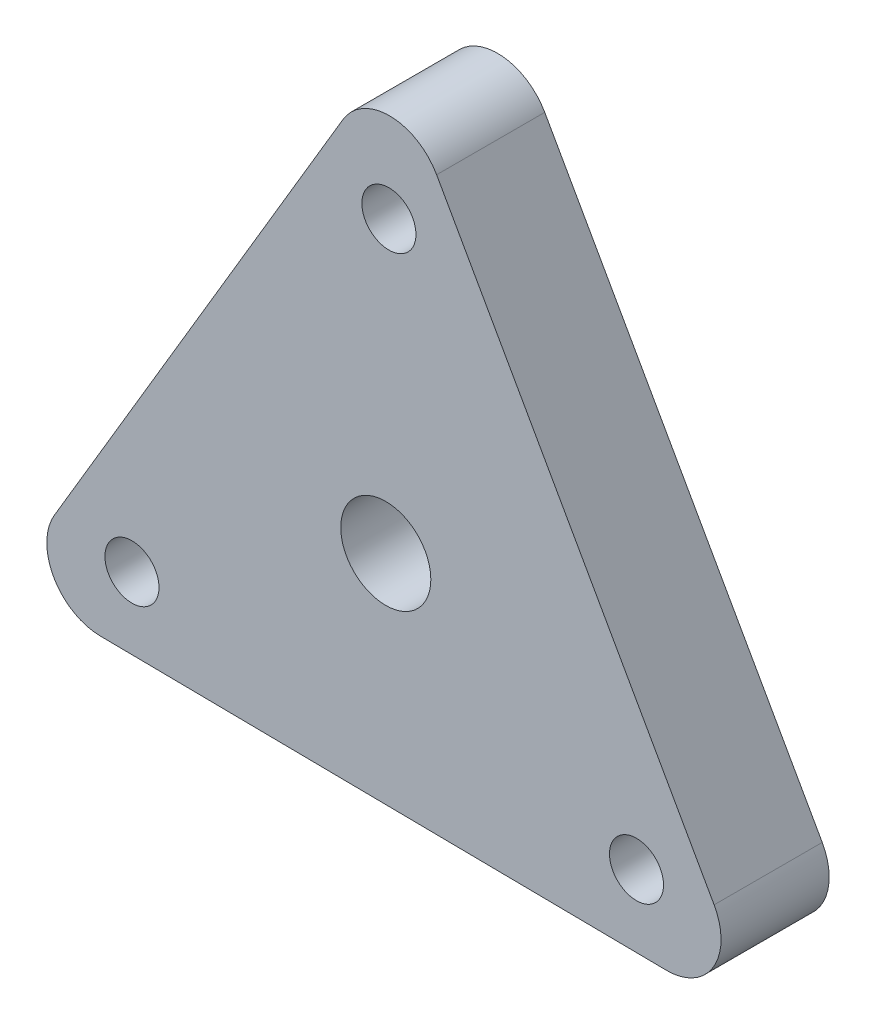
ISO-10303-21;
HEADER;
FILE_DESCRIPTION(('STEP AP214'),'2;1');
FILE_NAME('part.step','',(''),(''),'','','');
FILE_SCHEMA(('AUTOMOTIVE_DESIGN { 1 0 10303 214 1 1 1 1 }'));
ENDSEC;
DATA;
#1=APPLICATION_CONTEXT('core data for automotive mechanical design processes');
#2=APPLICATION_PROTOCOL_DEFINITION('international standard','automotive_design',2000,#1);
#3=PRODUCT_CONTEXT('',#1,'mechanical');
#4=PRODUCT('Part','Part','',(#3));
#5=PRODUCT_RELATED_PRODUCT_CATEGORY('part','',(#4));
#6=PRODUCT_DEFINITION_FORMATION('','',#4);
#7=PRODUCT_DEFINITION_CONTEXT('part definition',#1,'design');
#8=PRODUCT_DEFINITION('design','',#6,#7);
#9=PRODUCT_DEFINITION_SHAPE('','',#8);
#10=(LENGTH_UNIT() NAMED_UNIT(*) SI_UNIT(.MILLI.,.METRE.));
#11=(NAMED_UNIT(*) PLANE_ANGLE_UNIT() SI_UNIT($,.RADIAN.));
#12=(NAMED_UNIT(*) SI_UNIT($,.STERADIAN.) SOLID_ANGLE_UNIT());
#13=UNCERTAINTY_MEASURE_WITH_UNIT(LENGTH_MEASURE(1.E-05),#10,'distance_accuracy_value','');
#14=(GEOMETRIC_REPRESENTATION_CONTEXT(3) GLOBAL_UNCERTAINTY_ASSIGNED_CONTEXT((#13)) GLOBAL_UNIT_ASSIGNED_CONTEXT((#10,
#11,#12)) REPRESENTATION_CONTEXT('',''));
#15=CARTESIAN_POINT('',(0.,0.,0.));
#16=DIRECTION('',(0.,0.,1.));
#17=DIRECTION('',(1.,0.,0.));
#18=AXIS2_PLACEMENT_3D('',#15,#16,#17);
#19=CARTESIAN_POINT('',(-10.383384833885,6.1535165247396,6.));
#20=DIRECTION('',(0.860277013596666,-0.509826892069456,0.));
#21=DIRECTION('',(0.509826892069456,0.860277013596667,0.));
#22=AXIS2_PLACEMENT_3D('',#19,#20,#21);
#23=PLANE('',#22);
#24=DIRECTION('',(-0.509826892069456,-0.860277013596667,0.));
#25=VECTOR('',#24,1.);
#26=CARTESIAN_POINT('',(-10.383384833885,6.1535165247396,0.));
#27=LINE('',#26,#25);
#28=CARTESIAN_POINT('',(-2.37431980820905,19.6679361231694,0.));
#29=VERTEX_POINT('',#28);
#30=CARTESIAN_POINT('',(-18.392449859561,-7.36090307369022,0.));
#31=VERTEX_POINT('',#30);
#32=EDGE_CURVE('E116',#29,#31,#27,.T.);
#33=ORIENTED_EDGE('',*,*,#32,.T.);
#34=DIRECTION('',(0.,0.,-1.));
#35=VECTOR('',#34,1.);
#36=CARTESIAN_POINT('',(-18.392449859561,-7.36090307369022,6.));
#37=LINE('',#36,#35);
#38=CARTESIAN_POINT('',(-18.392449859561,-7.36090307369022,6.));
#39=VERTEX_POINT('',#38);
#40=EDGE_CURVE('E94',#31,#39,#37,.F.);
#41=ORIENTED_EDGE('',*,*,#40,.T.);
#42=DIRECTION('',(-0.509826892069456,-0.860277013596667,0.));
#43=VECTOR('',#42,1.);
#44=CARTESIAN_POINT('',(-10.383384833885,6.1535165247396,6.));
#45=LINE('',#44,#43);
#46=CARTESIAN_POINT('',(-2.37431980820905,19.6679361231694,6.));
#47=VERTEX_POINT('',#46);
#48=EDGE_CURVE('E142',#47,#39,#45,.T.);
#49=ORIENTED_EDGE('',*,*,#48,.F.);
#50=DIRECTION('',(0.,0.,-1.));
#51=VECTOR('',#50,1.);
#52=CARTESIAN_POINT('',(-2.37431980820905,19.6679361231694,6.));
#53=LINE('',#52,#51);
#54=EDGE_CURVE('E99',#47,#29,#53,.T.);
#55=ORIENTED_EDGE('',*,*,#54,.T.);
#56=EDGE_LOOP('',(#33,#41,#49,#55));
#57=FACE_BOUND('',#56,.T.);
#58=ADVANCED_FACE('F35',(#57),#23,.F.);
#59=CARTESIAN_POINT('',(-0.137409216089318,-12.0690333057843,6.));
#60=DIRECTION('',(0.0113845332662825,0.999935194101252,0.));
#61=DIRECTION('',(-0.999935194101252,0.0113845332662825,0.));
#62=AXIS2_PLACEMENT_3D('',#59,#60,#61);
#63=PLANE('',#62);
#64=DIRECTION('',(0.999935194101252,-0.0113845332662825,0.));
#65=VECTOR('',#64,1.);
#66=CARTESIAN_POINT('',(-0.137409216089318,-12.0690333057843,6.));
#67=LINE('',#66,#65);
#68=CARTESIAN_POINT('',(-15.8457724185698,-11.8901893322023,6.));
#69=VERTEX_POINT('',#68);
#70=CARTESIAN_POINT('',(15.5709539863912,-12.2478772793662,6.));
#71=VERTEX_POINT('',#70);
#72=EDGE_CURVE('E108',#69,#71,#67,.T.);
#73=ORIENTED_EDGE('',*,*,#72,.F.);
#74=DIRECTION('',(0.,0.,-1.));
#75=VECTOR('',#74,1.);
#76=CARTESIAN_POINT('',(-15.8457724185698,-11.8901893322023,6.));
#77=LINE('',#76,#75);
#78=CARTESIAN_POINT('',(-15.8457724185698,-11.8901893322023,0.));
#79=VERTEX_POINT('',#78);
#80=EDGE_CURVE('E93',#69,#79,#77,.T.);
#81=ORIENTED_EDGE('',*,*,#80,.T.);
#82=DIRECTION('',(0.999935194101252,-0.0113845332662825,0.));
#83=VECTOR('',#82,1.);
#84=CARTESIAN_POINT('',(-0.137409216089318,-12.0690333057843,0.));
#85=LINE('',#84,#83);
#86=CARTESIAN_POINT('',(15.5709539863912,-12.2478772793662,0.));
#87=VERTEX_POINT('',#86);
#88=EDGE_CURVE('E106',#79,#87,#85,.T.);
#89=ORIENTED_EDGE('',*,*,#88,.T.);
#90=DIRECTION('',(0.,0.,-1.));
#91=VECTOR('',#90,1.);
#92=CARTESIAN_POINT('',(15.5709539863912,-12.2478772793662,6.));
#93=LINE('',#92,#91);
#94=EDGE_CURVE('E110',#87,#71,#93,.F.);
#95=ORIENTED_EDGE('',*,*,#94,.T.);
#96=EDGE_LOOP('',(#73,#81,#89,#95));
#97=FACE_BOUND('',#96,.T.);
#98=ADVANCED_FACE('F105',(#97),#63,.F.);
#99=CARTESIAN_POINT('',(10.5207940499743,5.91551678104468,6.));
#100=DIRECTION('',(-0.871661546862949,-0.490108302031796,0.));
#101=DIRECTION('',(0.490108302031796,-0.871661546862949,0.));
#102=AXIS2_PLACEMENT_3D('',#99,#100,#101);
#103=PLANE('',#102);
#104=DIRECTION('',(-0.490108302031796,0.871661546862949,0.));
#105=VECTOR('',#104,1.);
#106=CARTESIAN_POINT('',(10.5207940499743,5.91551678104468,6.));
#107=LINE('',#106,#105);
#108=CARTESIAN_POINT('',(18.2200922267788,-7.77774679096706,6.));
#109=VERTEX_POINT('',#108);
#110=CARTESIAN_POINT('',(2.82149587316979,19.6087803530564,6.));
#111=VERTEX_POINT('',#110);
#112=EDGE_CURVE('E148',#109,#111,#107,.T.);
#113=ORIENTED_EDGE('',*,*,#112,.F.);
#114=DIRECTION('',(0.,0.,-1.));
#115=VECTOR('',#114,1.);
#116=CARTESIAN_POINT('',(18.2200922267788,-7.77774679096706,6.));
#117=LINE('',#116,#115);
#118=CARTESIAN_POINT('',(18.2200922267788,-7.77774679096706,0.));
#119=VERTEX_POINT('',#118);
#120=EDGE_CURVE('E11',#109,#119,#117,.T.);
#121=ORIENTED_EDGE('',*,*,#120,.T.);
#122=DIRECTION('',(-0.490108302031796,0.871661546862949,0.));
#123=VECTOR('',#122,1.);
#124=CARTESIAN_POINT('',(10.5207940499743,5.91551678104468,0.));
#125=LINE('',#124,#123);
#126=CARTESIAN_POINT('',(2.82149587316979,19.6087803530564,0.));
#127=VERTEX_POINT('',#126);
#128=EDGE_CURVE('E115',#119,#127,#125,.T.);
#129=ORIENTED_EDGE('',*,*,#128,.T.);
#130=DIRECTION('',(0.,0.,-1.));
#131=VECTOR('',#130,1.);
#132=CARTESIAN_POINT('',(2.82149587316979,19.6087803530564,6.));
#133=LINE('',#132,#131);
#134=EDGE_CURVE('E43',#127,#111,#133,.F.);
#135=ORIENTED_EDGE('',*,*,#134,.T.);
#136=EDGE_LOOP('',(#113,#121,#129,#135));
#137=FACE_BOUND('',#136,.T.);
#138=ADVANCED_FACE('F170',(#137),#103,.F.);
#139=CARTESIAN_POINT('',(13.9124878570264,-8.23261896126785,6.));
#140=DIRECTION('',(0.,0.,-1.));
#141=DIRECTION('',(-1.,0.,0.));
#142=AXIS2_PLACEMENT_3D('',#139,#140,#141);
#143=CYLINDRICAL_SURFACE('',#142,1.5);
#144=CARTESIAN_POINT('',(13.9124878570264,-8.23261896126785,6.));
#145=DIRECTION('',(0.,0.,1.));
#146=DIRECTION('',(1.,0.,0.));
#147=AXIS2_PLACEMENT_3D('',#144,#145,#146);
#148=CIRCLE('',#147,1.5);
#149=CARTESIAN_POINT('',(15.4124878570264,-8.23261896126785,6.));
#150=VERTEX_POINT('',#149);
#151=EDGE_CURVE('E146',#150,#150,#148,.T.);
#152=ORIENTED_EDGE('',*,*,#151,.T.);
#153=EDGE_LOOP('',(#152));
#154=FACE_BOUND('',#153,.T.);
#155=CARTESIAN_POINT('',(13.9124878570264,-8.23261896126785,0.));
#156=DIRECTION('',(0.,0.,1.));
#157=DIRECTION('',(1.,0.,0.));
#158=AXIS2_PLACEMENT_3D('',#155,#156,#157);
#159=CIRCLE('',#158,1.5);
#160=CARTESIAN_POINT('',(15.4124878570264,-8.23261896126785,0.));
#161=VERTEX_POINT('',#160);
#162=EDGE_CURVE('E120',#161,#161,#159,.T.);
#163=ORIENTED_EDGE('',*,*,#162,.F.);
#164=EDGE_LOOP('',(#163));
#165=FACE_BOUND('',#164,.T.);
#166=ADVANCED_FACE('F167',(#154,#165),#143,.F.);
#167=CARTESIAN_POINT('',(0.173413231622232,16.1648773946613,6.));
#168=DIRECTION('',(0.,0.,-1.));
#169=DIRECTION('',(-1.,0.,0.));
#170=AXIS2_PLACEMENT_3D('',#167,#168,#169);
#171=CYLINDRICAL_SURFACE('',#170,1.5);
#172=CARTESIAN_POINT('',(0.173413231622232,16.1648773946613,6.));
#173=DIRECTION('',(0.,0.,1.));
#174=DIRECTION('',(1.,0.,0.));
#175=AXIS2_PLACEMENT_3D('',#172,#173,#174);
#176=CIRCLE('',#175,1.5);
#177=CARTESIAN_POINT('',(1.67341323162223,16.1648773946613,6.));
#178=VERTEX_POINT('',#177);
#179=EDGE_CURVE('E151',#178,#178,#176,.T.);
#180=ORIENTED_EDGE('',*,*,#179,.T.);
#181=EDGE_LOOP('',(#180));
#182=FACE_BOUND('',#181,.T.);
#183=CARTESIAN_POINT('',(0.173413231622232,16.1648773946613,0.));
#184=DIRECTION('',(0.,0.,1.));
#185=DIRECTION('',(1.,0.,0.));
#186=AXIS2_PLACEMENT_3D('',#183,#184,#185);
#187=CIRCLE('',#186,1.5);
#188=CARTESIAN_POINT('',(1.67341323162223,16.1648773946613,0.));
#189=VERTEX_POINT('',#188);
#190=EDGE_CURVE('E161',#189,#189,#187,.T.);
#191=ORIENTED_EDGE('',*,*,#190,.F.);
#192=EDGE_LOOP('',(#191));
#193=FACE_BOUND('',#192,.T.);
#194=ADVANCED_FACE('F169',(#182,#193),#171,.F.);
#195=CARTESIAN_POINT('',(-14.0859010886486,-7.93225843339344,6.));
#196=DIRECTION('',(0.,0.,-1.));
#197=DIRECTION('',(-1.,0.,0.));
#198=AXIS2_PLACEMENT_3D('',#195,#196,#197);
#199=CYLINDRICAL_SURFACE('',#198,1.5);
#200=CARTESIAN_POINT('',(-14.0859010886486,-7.93225843339344,6.));
#201=DIRECTION('',(0.,0.,1.));
#202=DIRECTION('',(1.,0.,0.));
#203=AXIS2_PLACEMENT_3D('',#200,#201,#202);
#204=CIRCLE('',#203,1.5);
#205=CARTESIAN_POINT('',(-12.5859010886486,-7.93225843339344,6.));
#206=VERTEX_POINT('',#205);
#207=EDGE_CURVE('E126',#206,#206,#204,.T.);
#208=ORIENTED_EDGE('',*,*,#207,.T.);
#209=EDGE_LOOP('',(#208));
#210=FACE_BOUND('',#209,.T.);
#211=CARTESIAN_POINT('',(-14.0859010886486,-7.93225843339344,0.));
#212=DIRECTION('',(0.,0.,1.));
#213=DIRECTION('',(1.,0.,0.));
#214=AXIS2_PLACEMENT_3D('',#211,#212,#213);
#215=CIRCLE('',#214,1.5);
#216=CARTESIAN_POINT('',(-12.5859010886486,-7.93225843339344,0.));
#217=VERTEX_POINT('',#216);
#218=EDGE_CURVE('E158',#217,#217,#215,.T.);
#219=ORIENTED_EDGE('',*,*,#218,.F.);
#220=EDGE_LOOP('',(#219));
#221=FACE_BOUND('',#220,.T.);
#222=ADVANCED_FACE('F177',(#210,#221),#199,.F.);
#223=CARTESIAN_POINT('',(0.,0.,6.));
#224=DIRECTION('',(0.,0.,-1.));
#225=DIRECTION('',(-1.,0.,0.));
#226=AXIS2_PLACEMENT_3D('',#223,#224,#225);
#227=CYLINDRICAL_SURFACE('',#226,2.5);
#228=CARTESIAN_POINT('',(0.,0.,6.));
#229=DIRECTION('',(0.,0.,1.));
#230=DIRECTION('',(1.,0.,0.));
#231=AXIS2_PLACEMENT_3D('',#228,#229,#230);
#232=CIRCLE('',#231,2.5);
#233=CARTESIAN_POINT('',(2.5,0.,6.));
#234=VERTEX_POINT('',#233);
#235=EDGE_CURVE('E127',#234,#234,#232,.T.);
#236=ORIENTED_EDGE('',*,*,#235,.T.);
#237=EDGE_LOOP('',(#236));
#238=FACE_BOUND('',#237,.T.);
#239=CARTESIAN_POINT('',(0.,0.,0.));
#240=DIRECTION('',(0.,0.,1.));
#241=DIRECTION('',(1.,0.,0.));
#242=AXIS2_PLACEMENT_3D('',#239,#240,#241);
#243=CIRCLE('',#242,2.5);
#244=CARTESIAN_POINT('',(2.5,0.,0.));
#245=VERTEX_POINT('',#244);
#246=EDGE_CURVE('E118',#245,#245,#243,.T.);
#247=ORIENTED_EDGE('',*,*,#246,.F.);
#248=EDGE_LOOP('',(#247));
#249=FACE_BOUND('',#248,.T.);
#250=ADVANCED_FACE('F188',(#238,#249),#227,.F.);
#251=CARTESIAN_POINT('',(0.,0.,6.));
#252=DIRECTION('',(0.,0.,1.));
#253=DIRECTION('',(1.,0.,0.));
#254=AXIS2_PLACEMENT_3D('',#251,#252,#253);
#255=PLANE('',#254);
#256=ORIENTED_EDGE('',*,*,#207,.F.);
#257=EDGE_LOOP('',(#256));
#258=FACE_BOUND('',#257,.T.);
#259=ORIENTED_EDGE('',*,*,#179,.F.);
#260=EDGE_LOOP('',(#259));
#261=FACE_BOUND('',#260,.T.);
#262=ORIENTED_EDGE('',*,*,#151,.F.);
#263=EDGE_LOOP('',(#262));
#264=FACE_BOUND('',#263,.T.);
#265=ORIENTED_EDGE('',*,*,#48,.T.);
#266=CARTESIAN_POINT('',(-15.811618818771,-8.89038374989858,6.));
#267=DIRECTION('',(0.,0.,1.));
#268=DIRECTION('',(1.,0.,0.));
#269=AXIS2_PLACEMENT_3D('',#266,#267,#268);
#270=CIRCLE('',#269,3.);
#271=EDGE_CURVE('E137',#39,#69,#270,.T.);
#272=ORIENTED_EDGE('',*,*,#271,.T.);
#273=ORIENTED_EDGE('',*,*,#72,.T.);
#274=CARTESIAN_POINT('',(15.60510758619,-9.24807169706245,6.));
#275=DIRECTION('',(0.,0.,1.));
#276=DIRECTION('',(1.,0.,0.));
#277=AXIS2_PLACEMENT_3D('',#274,#275,#276);
#278=CIRCLE('',#277,3.);
#279=EDGE_CURVE('E56',#71,#109,#278,.T.);
#280=ORIENTED_EDGE('',*,*,#279,.T.);
#281=ORIENTED_EDGE('',*,*,#112,.T.);
#282=CARTESIAN_POINT('',(0.206511232580945,18.138455446961,6.));
#283=DIRECTION('',(0.,0.,1.));
#284=DIRECTION('',(1.,0.,0.));
#285=AXIS2_PLACEMENT_3D('',#282,#283,#284);
#286=CIRCLE('',#285,3.);
#287=EDGE_CURVE('E134',#111,#47,#286,.T.);
#288=ORIENTED_EDGE('',*,*,#287,.T.);
#289=EDGE_LOOP('',(#265,#272,#273,#280,#281,#288));
#290=FACE_BOUND('',#289,.T.);
#291=ORIENTED_EDGE('',*,*,#235,.F.);
#292=EDGE_LOOP('',(#291));
#293=FACE_BOUND('',#292,.T.);
#294=ADVANCED_FACE('F139',(#258,#261,#264,#290,#293),#255,.T.);
#295=CARTESIAN_POINT('',(0.,0.,0.));
#296=DIRECTION('',(0.,0.,1.));
#297=DIRECTION('',(1.,0.,0.));
#298=AXIS2_PLACEMENT_3D('',#295,#296,#297);
#299=PLANE('',#298);
#300=ORIENTED_EDGE('',*,*,#218,.T.);
#301=EDGE_LOOP('',(#300));
#302=FACE_BOUND('',#301,.T.);
#303=ORIENTED_EDGE('',*,*,#190,.T.);
#304=EDGE_LOOP('',(#303));
#305=FACE_BOUND('',#304,.T.);
#306=ORIENTED_EDGE('',*,*,#162,.T.);
#307=EDGE_LOOP('',(#306));
#308=FACE_BOUND('',#307,.T.);
#309=ORIENTED_EDGE('',*,*,#88,.F.);
#310=CARTESIAN_POINT('',(-15.811618818771,-8.89038374989858,0.));
#311=DIRECTION('',(0.,0.,1.));
#312=DIRECTION('',(1.,0.,0.));
#313=AXIS2_PLACEMENT_3D('',#310,#311,#312);
#314=CIRCLE('',#313,3.);
#315=EDGE_CURVE('E89',#79,#31,#314,.F.);
#316=ORIENTED_EDGE('',*,*,#315,.T.);
#317=ORIENTED_EDGE('',*,*,#32,.F.);
#318=CARTESIAN_POINT('',(0.206511232580945,18.138455446961,0.));
#319=DIRECTION('',(0.,0.,1.));
#320=DIRECTION('',(1.,0.,0.));
#321=AXIS2_PLACEMENT_3D('',#318,#319,#320);
#322=CIRCLE('',#321,3.);
#323=EDGE_CURVE('E109',#29,#127,#322,.F.);
#324=ORIENTED_EDGE('',*,*,#323,.T.);
#325=ORIENTED_EDGE('',*,*,#128,.F.);
#326=CARTESIAN_POINT('',(15.60510758619,-9.24807169706245,0.));
#327=DIRECTION('',(0.,0.,1.));
#328=DIRECTION('',(1.,0.,0.));
#329=AXIS2_PLACEMENT_3D('',#326,#327,#328);
#330=CIRCLE('',#329,3.);
#331=EDGE_CURVE('E100',#119,#87,#330,.F.);
#332=ORIENTED_EDGE('',*,*,#331,.T.);
#333=EDGE_LOOP('',(#309,#316,#317,#324,#325,#332));
#334=FACE_BOUND('',#333,.T.);
#335=ORIENTED_EDGE('',*,*,#246,.T.);
#336=EDGE_LOOP('',(#335));
#337=FACE_BOUND('',#336,.T.);
#338=ADVANCED_FACE('F112',(#302,#305,#308,#334,#337),#299,.F.);
#339=CARTESIAN_POINT('',(-15.811618818771,-8.89038374989858,6.));
#340=DIRECTION('',(0.,0.,-1.));
#341=DIRECTION('',(-1.,0.,0.));
#342=AXIS2_PLACEMENT_3D('',#339,#340,#341);
#343=CYLINDRICAL_SURFACE('',#342,3.);
#344=ORIENTED_EDGE('',*,*,#271,.F.);
#345=ORIENTED_EDGE('',*,*,#40,.F.);
#346=ORIENTED_EDGE('',*,*,#315,.F.);
#347=ORIENTED_EDGE('',*,*,#80,.F.);
#348=EDGE_LOOP('',(#344,#345,#346,#347));
#349=FACE_BOUND('',#348,.T.);
#350=ADVANCED_FACE('F92',(#349),#343,.T.);
#351=CARTESIAN_POINT('',(15.60510758619,-9.24807169706245,6.));
#352=DIRECTION('',(0.,0.,-1.));
#353=DIRECTION('',(-1.,0.,0.));
#354=AXIS2_PLACEMENT_3D('',#351,#352,#353);
#355=CYLINDRICAL_SURFACE('',#354,3.);
#356=ORIENTED_EDGE('',*,*,#279,.F.);
#357=ORIENTED_EDGE('',*,*,#94,.F.);
#358=ORIENTED_EDGE('',*,*,#331,.F.);
#359=ORIENTED_EDGE('',*,*,#120,.F.);
#360=EDGE_LOOP('',(#356,#357,#358,#359));
#361=FACE_BOUND('',#360,.T.);
#362=ADVANCED_FACE('F219',(#361),#355,.T.);
#363=CARTESIAN_POINT('',(0.206511232580945,18.138455446961,6.));
#364=DIRECTION('',(0.,0.,-1.));
#365=DIRECTION('',(-1.,0.,0.));
#366=AXIS2_PLACEMENT_3D('',#363,#364,#365);
#367=CYLINDRICAL_SURFACE('',#366,3.);
#368=ORIENTED_EDGE('',*,*,#287,.F.);
#369=ORIENTED_EDGE('',*,*,#134,.F.);
#370=ORIENTED_EDGE('',*,*,#323,.F.);
#371=ORIENTED_EDGE('',*,*,#54,.F.);
#372=EDGE_LOOP('',(#368,#369,#370,#371));
#373=FACE_BOUND('',#372,.T.);
#374=ADVANCED_FACE('F37',(#373),#367,.T.);
#375=CLOSED_SHELL('',(#58,#98,#138,#166,#194,#222,#250,#294,#338,#350,#362,#374));
#376=MANIFOLD_SOLID_BREP('B2',#375);
#377=ADVANCED_BREP_SHAPE_REPRESENTATION('',(#18,#376),#14);
#378=SHAPE_DEFINITION_REPRESENTATION(#9,#377);
ENDSEC;
END-ISO-10303-21;
